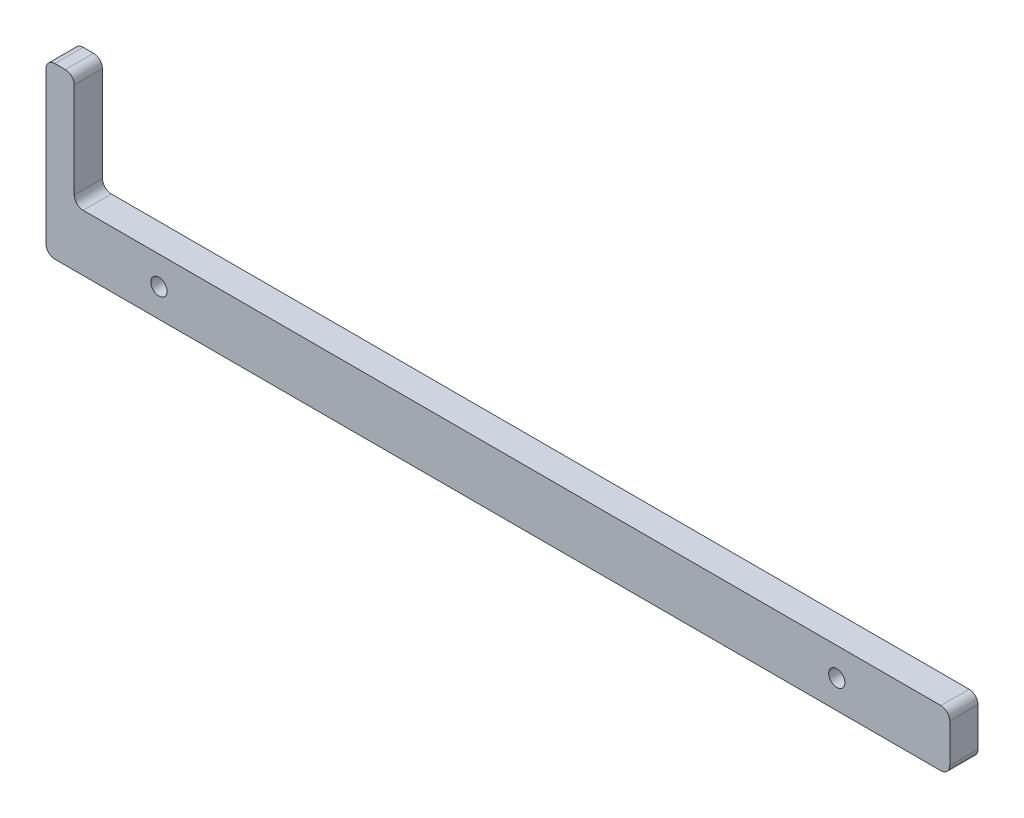
ISO-10303-21;
HEADER;
FILE_DESCRIPTION(('STEP AP214'),'2;1');
FILE_NAME('part.step','',(''),(''),'','','');
FILE_SCHEMA(('AUTOMOTIVE_DESIGN { 1 0 10303 214 1 1 1 1 }'));
ENDSEC;
DATA;
#1=APPLICATION_CONTEXT('core data for automotive mechanical design processes');
#2=APPLICATION_PROTOCOL_DEFINITION('international standard','automotive_design',2000,#1);
#3=PRODUCT_CONTEXT('',#1,'mechanical');
#4=PRODUCT('Part','Part','',(#3));
#5=PRODUCT_RELATED_PRODUCT_CATEGORY('part','',(#4));
#6=PRODUCT_DEFINITION_FORMATION('','',#4);
#7=PRODUCT_DEFINITION_CONTEXT('part definition',#1,'design');
#8=PRODUCT_DEFINITION('design','',#6,#7);
#9=PRODUCT_DEFINITION_SHAPE('','',#8);
#10=(LENGTH_UNIT() NAMED_UNIT(*) SI_UNIT(.MILLI.,.METRE.));
#11=(NAMED_UNIT(*) PLANE_ANGLE_UNIT() SI_UNIT($,.RADIAN.));
#12=(NAMED_UNIT(*) SI_UNIT($,.STERADIAN.) SOLID_ANGLE_UNIT());
#13=UNCERTAINTY_MEASURE_WITH_UNIT(LENGTH_MEASURE(1.E-05),#10,'distance_accuracy_value','');
#14=(GEOMETRIC_REPRESENTATION_CONTEXT(3) GLOBAL_UNCERTAINTY_ASSIGNED_CONTEXT((#13)) GLOBAL_UNIT_ASSIGNED_CONTEXT((#10,
#11,#12)) REPRESENTATION_CONTEXT('',''));
#15=CARTESIAN_POINT('',(0.,0.,0.));
#16=DIRECTION('',(0.,0.,1.));
#17=DIRECTION('',(1.,0.,0.));
#18=AXIS2_PLACEMENT_3D('',#15,#16,#17);
#19=CARTESIAN_POINT('',(0.,12.7,6.35));
#20=DIRECTION('',(0.,-1.,0.));
#21=DIRECTION('',(0.,0.,-1.));
#22=AXIS2_PLACEMENT_3D('',#19,#20,#21);
#23=PLANE('',#22);
#24=DIRECTION('',(-1.,0.,0.));
#25=VECTOR('',#24,1.);
#26=CARTESIAN_POINT('',(0.,12.7,6.35));
#27=LINE('',#26,#25);
#28=CARTESIAN_POINT('',(201.2,12.7,6.35));
#29=VERTEX_POINT('',#28);
#30=CARTESIAN_POINT('',(8.34999999999999,12.7,6.35));
#31=VERTEX_POINT('',#30);
#32=EDGE_CURVE('E174',#29,#31,#27,.T.);
#33=ORIENTED_EDGE('',*,*,#32,.F.);
#34=DIRECTION('',(0.,0.,-1.));
#35=VECTOR('',#34,1.);
#36=CARTESIAN_POINT('',(201.2,12.7,6.35));
#37=LINE('',#36,#35);
#38=CARTESIAN_POINT('',(201.2,12.7,0.));
#39=VERTEX_POINT('',#38);
#40=EDGE_CURVE('E207',#29,#39,#37,.T.);
#41=ORIENTED_EDGE('',*,*,#40,.T.);
#42=DIRECTION('',(-1.,0.,0.));
#43=VECTOR('',#42,1.);
#44=CARTESIAN_POINT('',(0.,12.7,0.));
#45=LINE('',#44,#43);
#46=CARTESIAN_POINT('',(8.35,12.7,0.));
#47=VERTEX_POINT('',#46);
#48=EDGE_CURVE('E161',#39,#47,#45,.T.);
#49=ORIENTED_EDGE('',*,*,#48,.T.);
#50=DIRECTION('',(0.,0.,-1.));
#51=VECTOR('',#50,1.);
#52=CARTESIAN_POINT('',(8.34999999999999,12.7,6.35));
#53=LINE('',#52,#51);
#54=EDGE_CURVE('E204',#47,#31,#53,.F.);
#55=ORIENTED_EDGE('',*,*,#54,.T.);
#56=EDGE_LOOP('',(#33,#41,#49,#55));
#57=FACE_BOUND('',#56,.T.);
#58=ADVANCED_FACE('F39',(#57),#23,.F.);
#59=CARTESIAN_POINT('',(0.,0.,6.35));
#60=DIRECTION('',(1.,0.,0.));
#61=DIRECTION('',(0.,0.,-1.));
#62=AXIS2_PLACEMENT_3D('',#59,#60,#61);
#63=PLANE('',#62);
#64=DIRECTION('',(0.,-1.,0.));
#65=VECTOR('',#64,1.);
#66=CARTESIAN_POINT('',(0.,0.,0.));
#67=LINE('',#66,#65);
#68=CARTESIAN_POINT('',(0.,36.1,0.));
#69=VERTEX_POINT('',#68);
#70=CARTESIAN_POINT('',(0.,2.,0.));
#71=VERTEX_POINT('',#70);
#72=EDGE_CURVE('E169',#69,#71,#67,.T.);
#73=ORIENTED_EDGE('',*,*,#72,.T.);
#74=DIRECTION('',(0.,0.,-1.));
#75=VECTOR('',#74,1.);
#76=CARTESIAN_POINT('',(0.,2.,6.35));
#77=LINE('',#76,#75);
#78=CARTESIAN_POINT('',(0.,2.,6.35));
#79=VERTEX_POINT('',#78);
#80=EDGE_CURVE('E214',#71,#79,#77,.F.);
#81=ORIENTED_EDGE('',*,*,#80,.T.);
#82=DIRECTION('',(0.,-1.,0.));
#83=VECTOR('',#82,1.);
#84=CARTESIAN_POINT('',(0.,0.,6.35));
#85=LINE('',#84,#83);
#86=CARTESIAN_POINT('',(0.,36.1,6.35));
#87=VERTEX_POINT('',#86);
#88=EDGE_CURVE('E167',#87,#79,#85,.T.);
#89=ORIENTED_EDGE('',*,*,#88,.F.);
#90=DIRECTION('',(0.,0.,1.));
#91=VECTOR('',#90,1.);
#92=CARTESIAN_POINT('',(0.,36.1,0.));
#93=LINE('',#92,#91);
#94=EDGE_CURVE('E211',#87,#69,#93,.F.);
#95=ORIENTED_EDGE('',*,*,#94,.T.);
#96=EDGE_LOOP('',(#73,#81,#89,#95));
#97=FACE_BOUND('',#96,.T.);
#98=ADVANCED_FACE('F284',(#97),#63,.F.);
#99=CARTESIAN_POINT('',(0.,0.,6.35));
#100=DIRECTION('',(0.,1.,0.));
#101=DIRECTION('',(0.,0.,1.));
#102=AXIS2_PLACEMENT_3D('',#99,#100,#101);
#103=PLANE('',#102);
#104=DIRECTION('',(1.,0.,0.));
#105=VECTOR('',#104,1.);
#106=CARTESIAN_POINT('',(0.,0.,0.));
#107=LINE('',#106,#105);
#108=CARTESIAN_POINT('',(2.,0.,0.));
#109=VERTEX_POINT('',#108);
#110=CARTESIAN_POINT('',(201.2,0.,0.));
#111=VERTEX_POINT('',#110);
#112=EDGE_CURVE('E162',#109,#111,#107,.T.);
#113=ORIENTED_EDGE('',*,*,#112,.T.);
#114=DIRECTION('',(0.,0.,-1.));
#115=VECTOR('',#114,1.);
#116=CARTESIAN_POINT('',(201.2,0.,6.35));
#117=LINE('',#116,#115);
#118=CARTESIAN_POINT('',(201.2,0.,6.35));
#119=VERTEX_POINT('',#118);
#120=EDGE_CURVE('E137',#111,#119,#117,.F.);
#121=ORIENTED_EDGE('',*,*,#120,.T.);
#122=DIRECTION('',(1.,0.,0.));
#123=VECTOR('',#122,1.);
#124=CARTESIAN_POINT('',(0.,0.,6.35));
#125=LINE('',#124,#123);
#126=CARTESIAN_POINT('',(2.,0.,6.35));
#127=VERTEX_POINT('',#126);
#128=EDGE_CURVE('E262',#127,#119,#125,.T.);
#129=ORIENTED_EDGE('',*,*,#128,.F.);
#130=DIRECTION('',(0.,0.,-1.));
#131=VECTOR('',#130,1.);
#132=CARTESIAN_POINT('',(2.,0.,6.35));
#133=LINE('',#132,#131);
#134=EDGE_CURVE('E143',#127,#109,#133,.T.);
#135=ORIENTED_EDGE('',*,*,#134,.T.);
#136=EDGE_LOOP('',(#113,#121,#129,#135));
#137=FACE_BOUND('',#136,.T.);
#138=ADVANCED_FACE('F289',(#137),#103,.F.);
#139=CARTESIAN_POINT('',(203.2,0.,6.35));
#140=DIRECTION('',(-1.,0.,0.));
#141=DIRECTION('',(0.,0.,1.));
#142=AXIS2_PLACEMENT_3D('',#139,#140,#141);
#143=PLANE('',#142);
#144=DIRECTION('',(0.,1.,0.));
#145=VECTOR('',#144,1.);
#146=CARTESIAN_POINT('',(203.2,0.,6.35));
#147=LINE('',#146,#145);
#148=CARTESIAN_POINT('',(203.2,2.,6.35));
#149=VERTEX_POINT('',#148);
#150=CARTESIAN_POINT('',(203.2,10.7,6.35));
#151=VERTEX_POINT('',#150);
#152=EDGE_CURVE('E153',#149,#151,#147,.T.);
#153=ORIENTED_EDGE('',*,*,#152,.F.);
#154=DIRECTION('',(0.,0.,-1.));
#155=VECTOR('',#154,1.);
#156=CARTESIAN_POINT('',(203.2,2.,6.35));
#157=LINE('',#156,#155);
#158=CARTESIAN_POINT('',(203.2,2.,0.));
#159=VERTEX_POINT('',#158);
#160=EDGE_CURVE('E136',#149,#159,#157,.T.);
#161=ORIENTED_EDGE('',*,*,#160,.T.);
#162=DIRECTION('',(0.,1.,0.));
#163=VECTOR('',#162,1.);
#164=CARTESIAN_POINT('',(203.2,0.,0.));
#165=LINE('',#164,#163);
#166=CARTESIAN_POINT('',(203.2,10.7,0.));
#167=VERTEX_POINT('',#166);
#168=EDGE_CURVE('E150',#159,#167,#165,.T.);
#169=ORIENTED_EDGE('',*,*,#168,.T.);
#170=DIRECTION('',(0.,0.,-1.));
#171=VECTOR('',#170,1.);
#172=CARTESIAN_POINT('',(203.2,10.7,6.35));
#173=LINE('',#172,#171);
#174=EDGE_CURVE('E156',#167,#151,#173,.F.);
#175=ORIENTED_EDGE('',*,*,#174,.T.);
#176=EDGE_LOOP('',(#153,#161,#169,#175));
#177=FACE_BOUND('',#176,.T.);
#178=ADVANCED_FACE('F149',(#177),#143,.F.);
#179=CARTESIAN_POINT('',(0.,0.,6.35));
#180=DIRECTION('',(0.,0.,-1.));
#181=DIRECTION('',(-1.,0.,0.));
#182=AXIS2_PLACEMENT_3D('',#179,#180,#181);
#183=PLANE('',#182);
#184=CARTESIAN_POINT('',(25.4,6.34999999999998,6.35));
#185=DIRECTION('',(0.,0.,1.));
#186=DIRECTION('',(1.,0.,0.));
#187=AXIS2_PLACEMENT_3D('',#184,#185,#186);
#188=CIRCLE('',#187,1.82879999999999);
#189=CARTESIAN_POINT('',(27.2288,6.34999999999998,6.35));
#190=VERTEX_POINT('',#189);
#191=EDGE_CURVE('E325',#190,#190,#188,.T.);
#192=ORIENTED_EDGE('',*,*,#191,.F.);
#193=EDGE_LOOP('',(#192));
#194=FACE_BOUND('',#193,.T.);
#195=CARTESIAN_POINT('',(177.8,6.35,6.35));
#196=DIRECTION('',(0.,0.,1.));
#197=DIRECTION('',(1.,0.,0.));
#198=AXIS2_PLACEMENT_3D('',#195,#196,#197);
#199=CIRCLE('',#198,1.82879999999999);
#200=CARTESIAN_POINT('',(179.6288,6.35,6.35));
#201=VERTEX_POINT('',#200);
#202=EDGE_CURVE('E317',#201,#201,#199,.T.);
#203=ORIENTED_EDGE('',*,*,#202,.F.);
#204=EDGE_LOOP('',(#203));
#205=FACE_BOUND('',#204,.T.);
#206=ORIENTED_EDGE('',*,*,#128,.T.);
#207=CARTESIAN_POINT('',(201.2,2.,6.35));
#208=DIRECTION('',(0.,0.,-1.));
#209=DIRECTION('',(-1.,0.,0.));
#210=AXIS2_PLACEMENT_3D('',#207,#208,#209);
#211=CIRCLE('',#210,2.);
#212=EDGE_CURVE('E201',#119,#149,#211,.F.);
#213=ORIENTED_EDGE('',*,*,#212,.T.);
#214=ORIENTED_EDGE('',*,*,#152,.T.);
#215=CARTESIAN_POINT('',(201.2,10.7,6.35));
#216=DIRECTION('',(0.,0.,-1.));
#217=DIRECTION('',(-1.,0.,0.));
#218=AXIS2_PLACEMENT_3D('',#215,#216,#217);
#219=CIRCLE('',#218,2.);
#220=EDGE_CURVE('E198',#151,#29,#219,.F.);
#221=ORIENTED_EDGE('',*,*,#220,.T.);
#222=ORIENTED_EDGE('',*,*,#32,.T.);
#223=CARTESIAN_POINT('',(8.34999999999999,14.7,6.35));
#224=DIRECTION('',(0.,0.,-1.));
#225=DIRECTION('',(-1.,0.,0.));
#226=AXIS2_PLACEMENT_3D('',#223,#224,#225);
#227=CIRCLE('',#226,2.);
#228=CARTESIAN_POINT('',(6.34999999999999,14.7,6.35));
#229=VERTEX_POINT('',#228);
#230=EDGE_CURVE('E11',#31,#229,#227,.T.);
#231=ORIENTED_EDGE('',*,*,#230,.T.);
#232=DIRECTION('',(0.,-1.,0.));
#233=VECTOR('',#232,1.);
#234=CARTESIAN_POINT('',(6.34999999999999,38.1,6.35));
#235=LINE('',#234,#233);
#236=CARTESIAN_POINT('',(6.34999999999999,36.1,6.35));
#237=VERTEX_POINT('',#236);
#238=EDGE_CURVE('E246',#237,#229,#235,.T.);
#239=ORIENTED_EDGE('',*,*,#238,.F.);
#240=CARTESIAN_POINT('',(4.34999999999999,36.1,6.35));
#241=DIRECTION('',(0.,0.,-1.));
#242=DIRECTION('',(-1.,0.,0.));
#243=AXIS2_PLACEMENT_3D('',#240,#241,#242);
#244=CIRCLE('',#243,2.);
#245=CARTESIAN_POINT('',(4.34999999999999,38.1,6.35));
#246=VERTEX_POINT('',#245);
#247=EDGE_CURVE('E56',#237,#246,#244,.F.);
#248=ORIENTED_EDGE('',*,*,#247,.T.);
#249=DIRECTION('',(1.,0.,0.));
#250=VECTOR('',#249,1.);
#251=CARTESIAN_POINT('',(0.,38.1,6.35));
#252=LINE('',#251,#250);
#253=CARTESIAN_POINT('',(2.,38.1,6.35));
#254=VERTEX_POINT('',#253);
#255=EDGE_CURVE('E313',#254,#246,#252,.T.);
#256=ORIENTED_EDGE('',*,*,#255,.F.);
#257=CARTESIAN_POINT('',(2.,36.1,6.35));
#258=DIRECTION('',(0.,0.,-1.));
#259=DIRECTION('',(-1.,0.,0.));
#260=AXIS2_PLACEMENT_3D('',#257,#258,#259);
#261=CIRCLE('',#260,2.);
#262=EDGE_CURVE('E64',#254,#87,#261,.F.);
#263=ORIENTED_EDGE('',*,*,#262,.T.);
#264=ORIENTED_EDGE('',*,*,#88,.T.);
#265=CARTESIAN_POINT('',(2.,2.,6.35));
#266=DIRECTION('',(0.,0.,-1.));
#267=DIRECTION('',(-1.,0.,0.));
#268=AXIS2_PLACEMENT_3D('',#265,#266,#267);
#269=CIRCLE('',#268,2.);
#270=EDGE_CURVE('E195',#79,#127,#269,.F.);
#271=ORIENTED_EDGE('',*,*,#270,.T.);
#272=EDGE_LOOP('',(#206,#213,#214,#221,#222,#231,#239,#248,#256,#263,#264,#271));
#273=FACE_BOUND('',#272,.T.);
#274=ADVANCED_FACE('F245',(#194,#205,#273),#183,.F.);
#275=CARTESIAN_POINT('',(0.,0.,0.));
#276=DIRECTION('',(0.,0.,-1.));
#277=DIRECTION('',(-1.,0.,0.));
#278=AXIS2_PLACEMENT_3D('',#275,#276,#277);
#279=PLANE('',#278);
#280=CARTESIAN_POINT('',(25.4,6.34999999999998,0.));
#281=DIRECTION('',(0.,0.,-1.));
#282=DIRECTION('',(-1.,0.,0.));
#283=AXIS2_PLACEMENT_3D('',#280,#281,#282);
#284=CIRCLE('',#283,1.82879999999999);
#285=CARTESIAN_POINT('',(23.5712,6.34999999999998,0.));
#286=VERTEX_POINT('',#285);
#287=EDGE_CURVE('E321',#286,#286,#284,.T.);
#288=ORIENTED_EDGE('',*,*,#287,.F.);
#289=EDGE_LOOP('',(#288));
#290=FACE_BOUND('',#289,.T.);
#291=CARTESIAN_POINT('',(177.8,6.35,0.));
#292=DIRECTION('',(0.,0.,-1.));
#293=DIRECTION('',(-1.,0.,0.));
#294=AXIS2_PLACEMENT_3D('',#291,#292,#293);
#295=CIRCLE('',#294,1.82879999999999);
#296=CARTESIAN_POINT('',(175.9712,6.35,0.));
#297=VERTEX_POINT('',#296);
#298=EDGE_CURVE('E43',#297,#297,#295,.T.);
#299=ORIENTED_EDGE('',*,*,#298,.F.);
#300=EDGE_LOOP('',(#299));
#301=FACE_BOUND('',#300,.T.);
#302=ORIENTED_EDGE('',*,*,#168,.F.);
#303=CARTESIAN_POINT('',(201.2,2.,0.));
#304=DIRECTION('',(0.,0.,-1.));
#305=DIRECTION('',(-1.,0.,0.));
#306=AXIS2_PLACEMENT_3D('',#303,#304,#305);
#307=CIRCLE('',#306,2.);
#308=EDGE_CURVE('E132',#159,#111,#307,.T.);
#309=ORIENTED_EDGE('',*,*,#308,.T.);
#310=ORIENTED_EDGE('',*,*,#112,.F.);
#311=CARTESIAN_POINT('',(2.,2.,0.));
#312=DIRECTION('',(0.,0.,-1.));
#313=DIRECTION('',(-1.,0.,0.));
#314=AXIS2_PLACEMENT_3D('',#311,#312,#313);
#315=CIRCLE('',#314,2.);
#316=EDGE_CURVE('E181',#109,#71,#315,.T.);
#317=ORIENTED_EDGE('',*,*,#316,.T.);
#318=ORIENTED_EDGE('',*,*,#72,.F.);
#319=CARTESIAN_POINT('',(2.,36.1,0.));
#320=DIRECTION('',(0.,0.,-1.));
#321=DIRECTION('',(-1.,0.,0.));
#322=AXIS2_PLACEMENT_3D('',#319,#320,#321);
#323=CIRCLE('',#322,2.);
#324=CARTESIAN_POINT('',(2.,38.1,0.));
#325=VERTEX_POINT('',#324);
#326=EDGE_CURVE('E178',#69,#325,#323,.T.);
#327=ORIENTED_EDGE('',*,*,#326,.T.);
#328=DIRECTION('',(-1.,0.,0.));
#329=VECTOR('',#328,1.);
#330=CARTESIAN_POINT('',(0.,38.1,0.));
#331=LINE('',#330,#329);
#332=CARTESIAN_POINT('',(4.35,38.1,0.));
#333=VERTEX_POINT('',#332);
#334=EDGE_CURVE('E255',#333,#325,#331,.T.);
#335=ORIENTED_EDGE('',*,*,#334,.F.);
#336=CARTESIAN_POINT('',(4.35,36.1,0.));
#337=DIRECTION('',(0.,0.,-1.));
#338=DIRECTION('',(-1.,0.,0.));
#339=AXIS2_PLACEMENT_3D('',#336,#337,#338);
#340=CIRCLE('',#339,2.);
#341=CARTESIAN_POINT('',(6.35,36.1,0.));
#342=VERTEX_POINT('',#341);
#343=EDGE_CURVE('E155',#333,#342,#340,.T.);
#344=ORIENTED_EDGE('',*,*,#343,.T.);
#345=DIRECTION('',(0.,-1.,0.));
#346=VECTOR('',#345,1.);
#347=CARTESIAN_POINT('',(6.35,38.1,0.));
#348=LINE('',#347,#346);
#349=CARTESIAN_POINT('',(6.35,14.7,0.));
#350=VERTEX_POINT('',#349);
#351=EDGE_CURVE('E234',#342,#350,#348,.T.);
#352=ORIENTED_EDGE('',*,*,#351,.T.);
#353=CARTESIAN_POINT('',(8.35,14.7,0.));
#354=DIRECTION('',(0.,0.,-1.));
#355=DIRECTION('',(-1.,0.,0.));
#356=AXIS2_PLACEMENT_3D('',#353,#354,#355);
#357=CIRCLE('',#356,2.);
#358=EDGE_CURVE('E49',#350,#47,#357,.F.);
#359=ORIENTED_EDGE('',*,*,#358,.T.);
#360=ORIENTED_EDGE('',*,*,#48,.F.);
#361=CARTESIAN_POINT('',(201.2,10.7,0.));
#362=DIRECTION('',(0.,0.,-1.));
#363=DIRECTION('',(-1.,0.,0.));
#364=AXIS2_PLACEMENT_3D('',#361,#362,#363);
#365=CIRCLE('',#364,2.);
#366=EDGE_CURVE('E144',#39,#167,#365,.T.);
#367=ORIENTED_EDGE('',*,*,#366,.T.);
#368=EDGE_LOOP('',(#302,#309,#310,#317,#318,#327,#335,#344,#352,#359,#360,#367));
#369=FACE_BOUND('',#368,.T.);
#370=ADVANCED_FACE('F158',(#290,#301,#369),#279,.T.);
#371=CARTESIAN_POINT('',(6.35,38.1,0.));
#372=DIRECTION('',(-1.,0.,0.));
#373=DIRECTION('',(0.,0.,1.));
#374=AXIS2_PLACEMENT_3D('',#371,#372,#373);
#375=PLANE('',#374);
#376=ORIENTED_EDGE('',*,*,#351,.F.);
#377=DIRECTION('',(0.,0.,-1.));
#378=VECTOR('',#377,1.);
#379=CARTESIAN_POINT('',(6.34999999999999,36.1,6.35));
#380=LINE('',#379,#378);
#381=EDGE_CURVE('E228',#342,#237,#380,.F.);
#382=ORIENTED_EDGE('',*,*,#381,.T.);
#383=ORIENTED_EDGE('',*,*,#238,.T.);
#384=DIRECTION('',(0.,0.,-1.));
#385=VECTOR('',#384,1.);
#386=CARTESIAN_POINT('',(6.35,14.7,0.));
#387=LINE('',#386,#385);
#388=EDGE_CURVE('E224',#229,#350,#387,.T.);
#389=ORIENTED_EDGE('',*,*,#388,.T.);
#390=EDGE_LOOP('',(#376,#382,#383,#389));
#391=FACE_BOUND('',#390,.T.);
#392=ADVANCED_FACE('F248',(#391),#375,.F.);
#393=CARTESIAN_POINT('',(0.,38.1,0.));
#394=DIRECTION('',(0.,1.,0.));
#395=DIRECTION('',(0.,0.,1.));
#396=AXIS2_PLACEMENT_3D('',#393,#394,#395);
#397=PLANE('',#396);
#398=ORIENTED_EDGE('',*,*,#334,.T.);
#399=DIRECTION('',(0.,0.,1.));
#400=VECTOR('',#399,1.);
#401=CARTESIAN_POINT('',(2.,38.1,6.35));
#402=LINE('',#401,#400);
#403=EDGE_CURVE('E221',#325,#254,#402,.T.);
#404=ORIENTED_EDGE('',*,*,#403,.T.);
#405=ORIENTED_EDGE('',*,*,#255,.T.);
#406=DIRECTION('',(0.,0.,-1.));
#407=VECTOR('',#406,1.);
#408=CARTESIAN_POINT('',(4.35,38.1,0.));
#409=LINE('',#408,#407);
#410=EDGE_CURVE('E217',#246,#333,#409,.T.);
#411=ORIENTED_EDGE('',*,*,#410,.T.);
#412=EDGE_LOOP('',(#398,#404,#405,#411));
#413=FACE_BOUND('',#412,.T.);
#414=ADVANCED_FACE('F281',(#413),#397,.T.);
#415=CARTESIAN_POINT('',(201.2,2.,6.35));
#416=DIRECTION('',(0.,0.,-1.));
#417=DIRECTION('',(-1.,0.,0.));
#418=AXIS2_PLACEMENT_3D('',#415,#416,#417);
#419=CYLINDRICAL_SURFACE('',#418,2.);
#420=ORIENTED_EDGE('',*,*,#212,.F.);
#421=ORIENTED_EDGE('',*,*,#120,.F.);
#422=ORIENTED_EDGE('',*,*,#308,.F.);
#423=ORIENTED_EDGE('',*,*,#160,.F.);
#424=EDGE_LOOP('',(#420,#421,#422,#423));
#425=FACE_BOUND('',#424,.T.);
#426=ADVANCED_FACE('F135',(#425),#419,.T.);
#427=CARTESIAN_POINT('',(201.2,10.7,6.35));
#428=DIRECTION('',(0.,0.,-1.));
#429=DIRECTION('',(-1.,0.,0.));
#430=AXIS2_PLACEMENT_3D('',#427,#428,#429);
#431=CYLINDRICAL_SURFACE('',#430,2.);
#432=ORIENTED_EDGE('',*,*,#220,.F.);
#433=ORIENTED_EDGE('',*,*,#174,.F.);
#434=ORIENTED_EDGE('',*,*,#366,.F.);
#435=ORIENTED_EDGE('',*,*,#40,.F.);
#436=EDGE_LOOP('',(#432,#433,#434,#435));
#437=FACE_BOUND('',#436,.T.);
#438=ADVANCED_FACE('F270',(#437),#431,.T.);
#439=CARTESIAN_POINT('',(2.,2.,6.35));
#440=DIRECTION('',(0.,0.,-1.));
#441=DIRECTION('',(-1.,0.,0.));
#442=AXIS2_PLACEMENT_3D('',#439,#440,#441);
#443=CYLINDRICAL_SURFACE('',#442,2.);
#444=ORIENTED_EDGE('',*,*,#270,.F.);
#445=ORIENTED_EDGE('',*,*,#80,.F.);
#446=ORIENTED_EDGE('',*,*,#316,.F.);
#447=ORIENTED_EDGE('',*,*,#134,.F.);
#448=EDGE_LOOP('',(#444,#445,#446,#447));
#449=FACE_BOUND('',#448,.T.);
#450=ADVANCED_FACE('F272',(#449),#443,.T.);
#451=CARTESIAN_POINT('',(2.,36.1,0.));
#452=DIRECTION('',(0.,0.,-1.));
#453=DIRECTION('',(-1.,0.,0.));
#454=AXIS2_PLACEMENT_3D('',#451,#452,#453);
#455=CYLINDRICAL_SURFACE('',#454,2.);
#456=ORIENTED_EDGE('',*,*,#326,.F.);
#457=ORIENTED_EDGE('',*,*,#94,.F.);
#458=ORIENTED_EDGE('',*,*,#262,.F.);
#459=ORIENTED_EDGE('',*,*,#403,.F.);
#460=EDGE_LOOP('',(#456,#457,#458,#459));
#461=FACE_BOUND('',#460,.T.);
#462=ADVANCED_FACE('F278',(#461),#455,.T.);
#463=CARTESIAN_POINT('',(4.35,36.1,0.));
#464=DIRECTION('',(0.,0.,1.));
#465=DIRECTION('',(1.,0.,0.));
#466=AXIS2_PLACEMENT_3D('',#463,#464,#465);
#467=CYLINDRICAL_SURFACE('',#466,2.);
#468=ORIENTED_EDGE('',*,*,#247,.F.);
#469=ORIENTED_EDGE('',*,*,#381,.F.);
#470=ORIENTED_EDGE('',*,*,#343,.F.);
#471=ORIENTED_EDGE('',*,*,#410,.F.);
#472=EDGE_LOOP('',(#468,#469,#470,#471));
#473=FACE_BOUND('',#472,.T.);
#474=ADVANCED_FACE('F346',(#473),#467,.T.);
#475=CARTESIAN_POINT('',(8.35,14.7,0.));
#476=DIRECTION('',(0.,0.,1.));
#477=DIRECTION('',(1.,0.,0.));
#478=AXIS2_PLACEMENT_3D('',#475,#476,#477);
#479=CYLINDRICAL_SURFACE('',#478,2.);
#480=ORIENTED_EDGE('',*,*,#230,.F.);
#481=ORIENTED_EDGE('',*,*,#54,.F.);
#482=ORIENTED_EDGE('',*,*,#358,.F.);
#483=ORIENTED_EDGE('',*,*,#388,.F.);
#484=EDGE_LOOP('',(#480,#481,#482,#483));
#485=FACE_BOUND('',#484,.T.);
#486=ADVANCED_FACE('F41',(#485),#479,.F.);
#487=CARTESIAN_POINT('',(177.8,6.35,6.35));
#488=DIRECTION('',(0.,0.,1.));
#489=DIRECTION('',(1.,0.,0.));
#490=AXIS2_PLACEMENT_3D('',#487,#488,#489);
#491=CYLINDRICAL_SURFACE('',#490,1.82879999999999);
#492=ORIENTED_EDGE('',*,*,#298,.T.);
#493=EDGE_LOOP('',(#492));
#494=FACE_BOUND('',#493,.T.);
#495=ORIENTED_EDGE('',*,*,#202,.T.);
#496=EDGE_LOOP('',(#495));
#497=FACE_BOUND('',#496,.T.);
#498=ADVANCED_FACE('F336',(#494,#497),#491,.F.);
#499=CARTESIAN_POINT('',(25.4,6.34999999999998,6.35));
#500=DIRECTION('',(0.,0.,1.));
#501=DIRECTION('',(1.,0.,0.));
#502=AXIS2_PLACEMENT_3D('',#499,#500,#501);
#503=CYLINDRICAL_SURFACE('',#502,1.82879999999999);
#504=ORIENTED_EDGE('',*,*,#287,.T.);
#505=EDGE_LOOP('',(#504));
#506=FACE_BOUND('',#505,.T.);
#507=ORIENTED_EDGE('',*,*,#191,.T.);
#508=EDGE_LOOP('',(#507));
#509=FACE_BOUND('',#508,.T.);
#510=ADVANCED_FACE('F330',(#506,#509),#503,.F.);
#511=CLOSED_SHELL('',(#58,#98,#138,#178,#274,#370,#392,#414,#426,#438,#450,#462,#474,#486,#498,#510));
#512=MANIFOLD_SOLID_BREP('B2',#511);
#513=ADVANCED_BREP_SHAPE_REPRESENTATION('',(#18,#512),#14);
#514=SHAPE_DEFINITION_REPRESENTATION(#9,#513);
ENDSEC;
END-ISO-10303-21;
